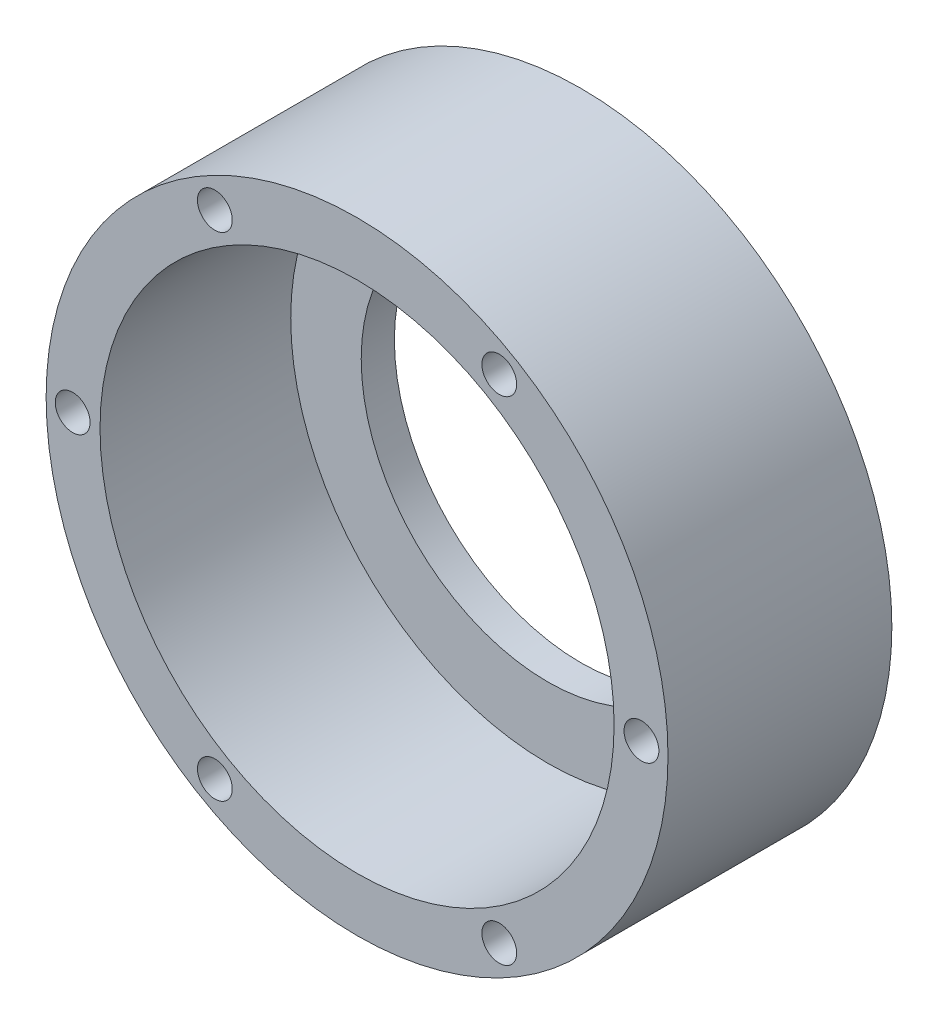
ISO-10303-21;
HEADER;
FILE_DESCRIPTION(('STEP AP214'),'2;1');
FILE_NAME('part.step','',(''),(''),'','','');
FILE_SCHEMA(('AUTOMOTIVE_DESIGN { 1 0 10303 214 1 1 1 1 }'));
ENDSEC;
DATA;
#1=APPLICATION_CONTEXT('core data for automotive mechanical design processes');
#2=APPLICATION_PROTOCOL_DEFINITION('international standard','automotive_design',2000,#1);
#3=PRODUCT_CONTEXT('',#1,'mechanical');
#4=PRODUCT('Part','Part','',(#3));
#5=PRODUCT_RELATED_PRODUCT_CATEGORY('part','',(#4));
#6=PRODUCT_DEFINITION_FORMATION('','',#4);
#7=PRODUCT_DEFINITION_CONTEXT('part definition',#1,'design');
#8=PRODUCT_DEFINITION('design','',#6,#7);
#9=PRODUCT_DEFINITION_SHAPE('','',#8);
#10=(LENGTH_UNIT() NAMED_UNIT(*) SI_UNIT(.MILLI.,.METRE.));
#11=(NAMED_UNIT(*) PLANE_ANGLE_UNIT() SI_UNIT($,.RADIAN.));
#12=(NAMED_UNIT(*) SI_UNIT($,.STERADIAN.) SOLID_ANGLE_UNIT());
#13=UNCERTAINTY_MEASURE_WITH_UNIT(LENGTH_MEASURE(1.E-05),#10,'distance_accuracy_value','');
#14=(GEOMETRIC_REPRESENTATION_CONTEXT(3) GLOBAL_UNCERTAINTY_ASSIGNED_CONTEXT((#13)) GLOBAL_UNIT_ASSIGNED_CONTEXT((#10,
#11,#12)) REPRESENTATION_CONTEXT('',''));
#15=CARTESIAN_POINT('',(0.,0.,0.));
#16=DIRECTION('',(0.,0.,1.));
#17=DIRECTION('',(1.,0.,0.));
#18=AXIS2_PLACEMENT_3D('',#15,#16,#17);
#19=CARTESIAN_POINT('',(0.,0.,27.));
#20=DIRECTION('',(0.,0.,-1.));
#21=DIRECTION('',(-1.,0.,0.));
#22=AXIS2_PLACEMENT_3D('',#19,#20,#21);
#23=CYLINDRICAL_SURFACE('',#22,37.5);
#24=CARTESIAN_POINT('',(0.,0.,27.));
#25=DIRECTION('',(0.,0.,1.));
#26=DIRECTION('',(1.,0.,0.));
#27=AXIS2_PLACEMENT_3D('',#24,#25,#26);
#28=CIRCLE('',#27,37.5);
#29=CARTESIAN_POINT('',(37.5,0.,27.));
#30=VERTEX_POINT('',#29);
#31=EDGE_CURVE('E10',#30,#30,#28,.T.);
#32=ORIENTED_EDGE('',*,*,#31,.F.);
#33=EDGE_LOOP('',(#32));
#34=FACE_BOUND('',#33,.T.);
#35=CARTESIAN_POINT('',(0.,0.,0.));
#36=DIRECTION('',(0.,0.,1.));
#37=DIRECTION('',(1.,0.,0.));
#38=AXIS2_PLACEMENT_3D('',#35,#36,#37);
#39=CIRCLE('',#38,37.5);
#40=CARTESIAN_POINT('',(37.5,0.,0.));
#41=VERTEX_POINT('',#40);
#42=EDGE_CURVE('E35',#41,#41,#39,.T.);
#43=ORIENTED_EDGE('',*,*,#42,.T.);
#44=EDGE_LOOP('',(#43));
#45=FACE_BOUND('',#44,.T.);
#46=ADVANCED_FACE('F32',(#34,#45),#23,.T.);
#47=CARTESIAN_POINT('',(0.,0.,27.));
#48=DIRECTION('',(0.,0.,1.));
#49=DIRECTION('',(1.,0.,0.));
#50=AXIS2_PLACEMENT_3D('',#47,#48,#49);
#51=PLANE('',#50);
#52=CARTESIAN_POINT('',(-17.1500000000003,-29.704671349806,27.));
#53=DIRECTION('',(0.,0.,1.));
#54=DIRECTION('',(0.50000000000001,0.866025403784433,0.));
#55=AXIS2_PLACEMENT_3D('',#52,#53,#54);
#56=CIRCLE('',#55,2.09999999999999);
#57=CARTESIAN_POINT('',(-16.1000000000003,-27.8860180018587,27.));
#58=VERTEX_POINT('',#57);
#59=EDGE_CURVE('E85',#58,#58,#56,.T.);
#60=ORIENTED_EDGE('',*,*,#59,.F.);
#61=EDGE_LOOP('',(#60));
#62=FACE_BOUND('',#61,.T.);
#63=CARTESIAN_POINT('',(17.1499999999997,-29.7046713498064,27.));
#64=DIRECTION('',(0.,0.,1.));
#65=DIRECTION('',(-0.499999999999992,0.866025403784443,0.));
#66=AXIS2_PLACEMENT_3D('',#63,#64,#65);
#67=CIRCLE('',#66,2.09999999999999);
#68=CARTESIAN_POINT('',(16.0999999999997,-27.8860180018591,27.));
#69=VERTEX_POINT('',#68);
#70=EDGE_CURVE('E79',#69,#69,#67,.T.);
#71=ORIENTED_EDGE('',*,*,#70,.F.);
#72=EDGE_LOOP('',(#71));
#73=FACE_BOUND('',#72,.T.);
#74=CARTESIAN_POINT('',(34.3,0.,27.));
#75=DIRECTION('',(0.,0.,1.));
#76=DIRECTION('',(-1.,0.,0.));
#77=AXIS2_PLACEMENT_3D('',#74,#75,#76);
#78=CIRCLE('',#77,2.09999999999999);
#79=CARTESIAN_POINT('',(32.2,0.,27.));
#80=VERTEX_POINT('',#79);
#81=EDGE_CURVE('E73',#80,#80,#78,.T.);
#82=ORIENTED_EDGE('',*,*,#81,.F.);
#83=EDGE_LOOP('',(#82));
#84=FACE_BOUND('',#83,.T.);
#85=CARTESIAN_POINT('',(17.1500000000001,29.7046713498062,27.));
#86=DIRECTION('',(0.,0.,1.));
#87=DIRECTION('',(-0.500000000000004,-0.866025403784436,0.));
#88=AXIS2_PLACEMENT_3D('',#85,#86,#87);
#89=CIRCLE('',#88,2.09999999999999);
#90=CARTESIAN_POINT('',(16.1000000000001,27.8860180018589,27.));
#91=VERTEX_POINT('',#90);
#92=EDGE_CURVE('E67',#91,#91,#89,.T.);
#93=ORIENTED_EDGE('',*,*,#92,.F.);
#94=EDGE_LOOP('',(#93));
#95=FACE_BOUND('',#94,.T.);
#96=CARTESIAN_POINT('',(-17.1499999999999,29.7046713498063,27.));
#97=DIRECTION('',(0.,0.,1.));
#98=DIRECTION('',(0.499999999999998,-0.86602540378444,0.));
#99=AXIS2_PLACEMENT_3D('',#96,#97,#98);
#100=CIRCLE('',#99,2.09999999999999);
#101=CARTESIAN_POINT('',(-16.0999999999999,27.886018001859,27.));
#102=VERTEX_POINT('',#101);
#103=EDGE_CURVE('E61',#102,#102,#100,.T.);
#104=ORIENTED_EDGE('',*,*,#103,.F.);
#105=EDGE_LOOP('',(#104));
#106=FACE_BOUND('',#105,.T.);
#107=CARTESIAN_POINT('',(-34.3,0.,27.));
#108=DIRECTION('',(0.,0.,1.));
#109=DIRECTION('',(1.,0.,0.));
#110=AXIS2_PLACEMENT_3D('',#107,#108,#109);
#111=CIRCLE('',#110,2.09999999999999);
#112=CARTESIAN_POINT('',(-32.2,0.,27.));
#113=VERTEX_POINT('',#112);
#114=EDGE_CURVE('E58',#113,#113,#111,.T.);
#115=ORIENTED_EDGE('',*,*,#114,.F.);
#116=EDGE_LOOP('',(#115));
#117=FACE_BOUND('',#116,.T.);
#118=CARTESIAN_POINT('',(0.,0.,27.));
#119=DIRECTION('',(0.,0.,1.));
#120=DIRECTION('',(1.,0.,0.));
#121=AXIS2_PLACEMENT_3D('',#118,#119,#120);
#122=CIRCLE('',#121,31.);
#123=CARTESIAN_POINT('',(31.,0.,27.));
#124=VERTEX_POINT('',#123);
#125=EDGE_CURVE('E44',#124,#124,#122,.T.);
#126=ORIENTED_EDGE('',*,*,#125,.F.);
#127=EDGE_LOOP('',(#126));
#128=FACE_BOUND('',#127,.T.);
#129=ORIENTED_EDGE('',*,*,#31,.T.);
#130=EDGE_LOOP('',(#129));
#131=FACE_BOUND('',#130,.T.);
#132=ADVANCED_FACE('F102',(#62,#73,#84,#95,#106,#117,#128,#131),#51,.T.);
#133=CARTESIAN_POINT('',(0.,0.,0.));
#134=DIRECTION('',(0.,0.,1.));
#135=DIRECTION('',(1.,0.,0.));
#136=AXIS2_PLACEMENT_3D('',#133,#134,#135);
#137=PLANE('',#136);
#138=CARTESIAN_POINT('',(-17.1500000000003,-29.704671349806,0.));
#139=DIRECTION('',(0.,0.,1.));
#140=DIRECTION('',(0.50000000000001,0.866025403784433,0.));
#141=AXIS2_PLACEMENT_3D('',#138,#139,#140);
#142=CIRCLE('',#141,2.1);
#143=CARTESIAN_POINT('',(-16.1000000000003,-27.8860180018587,0.));
#144=VERTEX_POINT('',#143);
#145=EDGE_CURVE('E88',#144,#144,#142,.T.);
#146=ORIENTED_EDGE('',*,*,#145,.T.);
#147=EDGE_LOOP('',(#146));
#148=FACE_BOUND('',#147,.T.);
#149=CARTESIAN_POINT('',(17.1499999999997,-29.7046713498064,0.));
#150=DIRECTION('',(0.,0.,1.));
#151=DIRECTION('',(-0.499999999999992,0.866025403784443,0.));
#152=AXIS2_PLACEMENT_3D('',#149,#150,#151);
#153=CIRCLE('',#152,2.1);
#154=CARTESIAN_POINT('',(16.0999999999997,-27.8860180018591,0.));
#155=VERTEX_POINT('',#154);
#156=EDGE_CURVE('E82',#155,#155,#153,.T.);
#157=ORIENTED_EDGE('',*,*,#156,.T.);
#158=EDGE_LOOP('',(#157));
#159=FACE_BOUND('',#158,.T.);
#160=CARTESIAN_POINT('',(34.3,0.,0.));
#161=DIRECTION('',(0.,0.,1.));
#162=DIRECTION('',(-1.,0.,0.));
#163=AXIS2_PLACEMENT_3D('',#160,#161,#162);
#164=CIRCLE('',#163,2.1);
#165=CARTESIAN_POINT('',(32.2,0.,0.));
#166=VERTEX_POINT('',#165);
#167=EDGE_CURVE('E76',#166,#166,#164,.T.);
#168=ORIENTED_EDGE('',*,*,#167,.T.);
#169=EDGE_LOOP('',(#168));
#170=FACE_BOUND('',#169,.T.);
#171=CARTESIAN_POINT('',(17.1500000000001,29.7046713498062,0.));
#172=DIRECTION('',(0.,0.,1.));
#173=DIRECTION('',(-0.500000000000004,-0.866025403784436,0.));
#174=AXIS2_PLACEMENT_3D('',#171,#172,#173);
#175=CIRCLE('',#174,2.1);
#176=CARTESIAN_POINT('',(16.1000000000001,27.8860180018589,0.));
#177=VERTEX_POINT('',#176);
#178=EDGE_CURVE('E70',#177,#177,#175,.T.);
#179=ORIENTED_EDGE('',*,*,#178,.T.);
#180=EDGE_LOOP('',(#179));
#181=FACE_BOUND('',#180,.T.);
#182=CARTESIAN_POINT('',(-17.1499999999999,29.7046713498063,0.));
#183=DIRECTION('',(0.,0.,1.));
#184=DIRECTION('',(0.499999999999998,-0.86602540378444,0.));
#185=AXIS2_PLACEMENT_3D('',#182,#183,#184);
#186=CIRCLE('',#185,2.1);
#187=CARTESIAN_POINT('',(-16.0999999999999,27.886018001859,0.));
#188=VERTEX_POINT('',#187);
#189=EDGE_CURVE('E64',#188,#188,#186,.T.);
#190=ORIENTED_EDGE('',*,*,#189,.T.);
#191=EDGE_LOOP('',(#190));
#192=FACE_BOUND('',#191,.T.);
#193=CARTESIAN_POINT('',(-34.3,0.,0.));
#194=DIRECTION('',(0.,0.,1.));
#195=DIRECTION('',(1.,0.,0.));
#196=AXIS2_PLACEMENT_3D('',#193,#194,#195);
#197=CIRCLE('',#196,2.1);
#198=CARTESIAN_POINT('',(-32.2,0.,0.));
#199=VERTEX_POINT('',#198);
#200=EDGE_CURVE('E55',#199,#199,#197,.T.);
#201=ORIENTED_EDGE('',*,*,#200,.T.);
#202=EDGE_LOOP('',(#201));
#203=FACE_BOUND('',#202,.T.);
#204=CARTESIAN_POINT('',(0.,0.,0.));
#205=DIRECTION('',(0.,0.,1.));
#206=DIRECTION('',(1.,0.,0.));
#207=AXIS2_PLACEMENT_3D('',#204,#205,#206);
#208=CIRCLE('',#207,22.5);
#209=CARTESIAN_POINT('',(22.5,0.,0.));
#210=VERTEX_POINT('',#209);
#211=EDGE_CURVE('E47',#210,#210,#208,.T.);
#212=ORIENTED_EDGE('',*,*,#211,.T.);
#213=EDGE_LOOP('',(#212));
#214=FACE_BOUND('',#213,.T.);
#215=ORIENTED_EDGE('',*,*,#42,.F.);
#216=EDGE_LOOP('',(#215));
#217=FACE_BOUND('',#216,.T.);
#218=ADVANCED_FACE('F92',(#148,#159,#170,#181,#192,#203,#214,#217),#137,.F.);
#219=CARTESIAN_POINT('',(0.,0.,4.));
#220=DIRECTION('',(0.,0.,1.));
#221=DIRECTION('',(1.,0.,0.));
#222=AXIS2_PLACEMENT_3D('',#219,#220,#221);
#223=CYLINDRICAL_SURFACE('',#222,31.);
#224=CARTESIAN_POINT('',(0.,0.,4.));
#225=DIRECTION('',(0.,0.,1.));
#226=DIRECTION('',(1.,0.,0.));
#227=AXIS2_PLACEMENT_3D('',#224,#225,#226);
#228=CIRCLE('',#227,31.);
#229=CARTESIAN_POINT('',(31.,0.,4.));
#230=VERTEX_POINT('',#229);
#231=EDGE_CURVE('E42',#230,#230,#228,.T.);
#232=ORIENTED_EDGE('',*,*,#231,.F.);
#233=EDGE_LOOP('',(#232));
#234=FACE_BOUND('',#233,.T.);
#235=ORIENTED_EDGE('',*,*,#125,.T.);
#236=EDGE_LOOP('',(#235));
#237=FACE_BOUND('',#236,.T.);
#238=ADVANCED_FACE('F118',(#234,#237),#223,.F.);
#239=CARTESIAN_POINT('',(0.,0.,4.));
#240=DIRECTION('',(0.,0.,1.));
#241=DIRECTION('',(1.,0.,0.));
#242=AXIS2_PLACEMENT_3D('',#239,#240,#241);
#243=PLANE('',#242);
#244=CARTESIAN_POINT('',(0.,0.,4.));
#245=DIRECTION('',(0.,0.,1.));
#246=DIRECTION('',(1.,0.,0.));
#247=AXIS2_PLACEMENT_3D('',#244,#245,#246);
#248=CIRCLE('',#247,22.5);
#249=CARTESIAN_POINT('',(22.5,0.,4.));
#250=VERTEX_POINT('',#249);
#251=EDGE_CURVE('E52',#250,#250,#248,.T.);
#252=ORIENTED_EDGE('',*,*,#251,.F.);
#253=EDGE_LOOP('',(#252));
#254=FACE_BOUND('',#253,.T.);
#255=ORIENTED_EDGE('',*,*,#231,.T.);
#256=EDGE_LOOP('',(#255));
#257=FACE_BOUND('',#256,.T.);
#258=ADVANCED_FACE('F120',(#254,#257),#243,.T.);
#259=CARTESIAN_POINT('',(0.,0.,-19.));
#260=DIRECTION('',(0.,0.,1.));
#261=DIRECTION('',(1.,0.,0.));
#262=AXIS2_PLACEMENT_3D('',#259,#260,#261);
#263=CYLINDRICAL_SURFACE('',#262,22.5);
#264=ORIENTED_EDGE('',*,*,#251,.T.);
#265=EDGE_LOOP('',(#264));
#266=FACE_BOUND('',#265,.T.);
#267=ORIENTED_EDGE('',*,*,#211,.F.);
#268=EDGE_LOOP('',(#267));
#269=FACE_BOUND('',#268,.T.);
#270=ADVANCED_FACE('F127',(#266,#269),#263,.F.);
#271=CARTESIAN_POINT('',(-34.3,0.,27.));
#272=DIRECTION('',(0.,0.,1.));
#273=DIRECTION('',(1.,0.,0.));
#274=AXIS2_PLACEMENT_3D('',#271,#272,#273);
#275=CYLINDRICAL_SURFACE('',#274,2.09999999999999);
#276=ORIENTED_EDGE('',*,*,#200,.F.);
#277=EDGE_LOOP('',(#276));
#278=FACE_BOUND('',#277,.T.);
#279=ORIENTED_EDGE('',*,*,#114,.T.);
#280=EDGE_LOOP('',(#279));
#281=FACE_BOUND('',#280,.T.);
#282=ADVANCED_FACE('F160',(#278,#281),#275,.F.);
#283=CARTESIAN_POINT('',(-17.1499999999999,29.7046713498063,27.));
#284=DIRECTION('',(0.,0.,1.));
#285=DIRECTION('',(0.499999999999998,-0.86602540378444,0.));
#286=AXIS2_PLACEMENT_3D('',#283,#284,#285);
#287=CYLINDRICAL_SURFACE('',#286,2.09999999999999);
#288=ORIENTED_EDGE('',*,*,#189,.F.);
#289=EDGE_LOOP('',(#288));
#290=FACE_BOUND('',#289,.T.);
#291=ORIENTED_EDGE('',*,*,#103,.T.);
#292=EDGE_LOOP('',(#291));
#293=FACE_BOUND('',#292,.T.);
#294=ADVANCED_FACE('F153',(#290,#293),#287,.F.);
#295=CARTESIAN_POINT('',(17.1500000000001,29.7046713498062,27.));
#296=DIRECTION('',(0.,0.,1.));
#297=DIRECTION('',(-0.500000000000004,-0.866025403784436,0.));
#298=AXIS2_PLACEMENT_3D('',#295,#296,#297);
#299=CYLINDRICAL_SURFACE('',#298,2.09999999999999);
#300=ORIENTED_EDGE('',*,*,#178,.F.);
#301=EDGE_LOOP('',(#300));
#302=FACE_BOUND('',#301,.T.);
#303=ORIENTED_EDGE('',*,*,#92,.T.);
#304=EDGE_LOOP('',(#303));
#305=FACE_BOUND('',#304,.T.);
#306=ADVANCED_FACE('F159',(#302,#305),#299,.F.);
#307=CARTESIAN_POINT('',(34.3,0.,27.));
#308=DIRECTION('',(0.,0.,1.));
#309=DIRECTION('',(-1.,0.,0.));
#310=AXIS2_PLACEMENT_3D('',#307,#308,#309);
#311=CYLINDRICAL_SURFACE('',#310,2.09999999999999);
#312=ORIENTED_EDGE('',*,*,#167,.F.);
#313=EDGE_LOOP('',(#312));
#314=FACE_BOUND('',#313,.T.);
#315=ORIENTED_EDGE('',*,*,#81,.T.);
#316=EDGE_LOOP('',(#315));
#317=FACE_BOUND('',#316,.T.);
#318=ADVANCED_FACE('F173',(#314,#317),#311,.F.);
#319=CARTESIAN_POINT('',(17.1499999999997,-29.7046713498064,27.));
#320=DIRECTION('',(0.,0.,1.));
#321=DIRECTION('',(-0.499999999999992,0.866025403784443,0.));
#322=AXIS2_PLACEMENT_3D('',#319,#320,#321);
#323=CYLINDRICAL_SURFACE('',#322,2.09999999999999);
#324=ORIENTED_EDGE('',*,*,#156,.F.);
#325=EDGE_LOOP('',(#324));
#326=FACE_BOUND('',#325,.T.);
#327=ORIENTED_EDGE('',*,*,#70,.T.);
#328=EDGE_LOOP('',(#327));
#329=FACE_BOUND('',#328,.T.);
#330=ADVANCED_FACE('F98',(#326,#329),#323,.F.);
#331=CARTESIAN_POINT('',(-17.1500000000003,-29.704671349806,27.));
#332=DIRECTION('',(0.,0.,1.));
#333=DIRECTION('',(0.50000000000001,0.866025403784433,0.));
#334=AXIS2_PLACEMENT_3D('',#331,#332,#333);
#335=CYLINDRICAL_SURFACE('',#334,2.09999999999999);
#336=ORIENTED_EDGE('',*,*,#145,.F.);
#337=EDGE_LOOP('',(#336));
#338=FACE_BOUND('',#337,.T.);
#339=ORIENTED_EDGE('',*,*,#59,.T.);
#340=EDGE_LOOP('',(#339));
#341=FACE_BOUND('',#340,.T.);
#342=ADVANCED_FACE('F95',(#338,#341),#335,.F.);
#343=CLOSED_SHELL('',(#46,#132,#218,#238,#258,#270,#282,#294,#306,#318,#330,#342));
#344=MANIFOLD_SOLID_BREP('B2',#343);
#345=ADVANCED_BREP_SHAPE_REPRESENTATION('',(#18,#344),#14);
#346=SHAPE_DEFINITION_REPRESENTATION(#9,#345);
ENDSEC;
END-ISO-10303-21;
